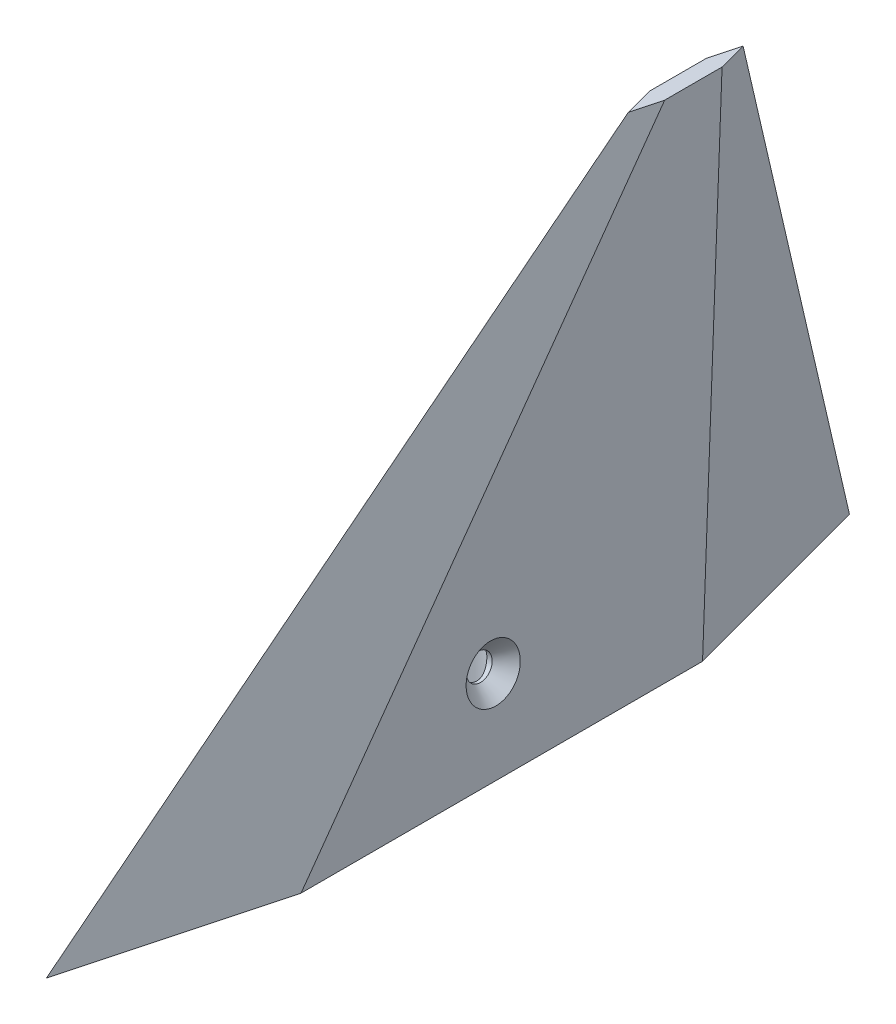
ISO-10303-21;
HEADER;
FILE_DESCRIPTION(('STEP AP214'),'2;1');
FILE_NAME('part.step','',(''),(''),'','','');
FILE_SCHEMA(('AUTOMOTIVE_DESIGN { 1 0 10303 214 1 1 1 1 }'));
ENDSEC;
DATA;
#1=APPLICATION_CONTEXT('core data for automotive mechanical design processes');
#2=APPLICATION_PROTOCOL_DEFINITION('international standard','automotive_design',2000,#1);
#3=PRODUCT_CONTEXT('',#1,'mechanical');
#4=PRODUCT('Part','Part','',(#3));
#5=PRODUCT_RELATED_PRODUCT_CATEGORY('part','',(#4));
#6=PRODUCT_DEFINITION_FORMATION('','',#4);
#7=PRODUCT_DEFINITION_CONTEXT('part definition',#1,'design');
#8=PRODUCT_DEFINITION('design','',#6,#7);
#9=PRODUCT_DEFINITION_SHAPE('','',#8);
#10=(LENGTH_UNIT() NAMED_UNIT(*) SI_UNIT(.MILLI.,.METRE.));
#11=(NAMED_UNIT(*) PLANE_ANGLE_UNIT() SI_UNIT($,.RADIAN.));
#12=(NAMED_UNIT(*) SI_UNIT($,.STERADIAN.) SOLID_ANGLE_UNIT());
#13=UNCERTAINTY_MEASURE_WITH_UNIT(LENGTH_MEASURE(1.E-05),#10,'distance_accuracy_value','');
#14=(GEOMETRIC_REPRESENTATION_CONTEXT(3) GLOBAL_UNCERTAINTY_ASSIGNED_CONTEXT((#13)) GLOBAL_UNIT_ASSIGNED_CONTEXT((#10,
#11,#12)) REPRESENTATION_CONTEXT('',''));
#15=CARTESIAN_POINT('',(0.,0.,0.));
#16=DIRECTION('',(0.,0.,1.));
#17=DIRECTION('',(1.,0.,0.));
#18=AXIS2_PLACEMENT_3D('',#15,#16,#17);
#19=CARTESIAN_POINT('',(0.,20.,-70.));
#20=DIRECTION('',(0.,1.,0.));
#21=DIRECTION('',(0.,0.,1.));
#22=AXIS2_PLACEMENT_3D('',#19,#20,#21);
#23=PLANE('',#22);
#24=CARTESIAN_POINT('',(0.,20.,-70.));
#25=DIRECTION('',(0.,1.,0.));
#26=DIRECTION('',(0.,0.,1.));
#27=AXIS2_PLACEMENT_3D('',#24,#25,#26);
#28=CIRCLE('',#27,5.05);
#29=CARTESIAN_POINT('',(0.,20.,-64.95));
#30=VERTEX_POINT('',#29);
#31=EDGE_CURVE('E18',#30,#30,#28,.F.);
#32=ORIENTED_EDGE('',*,*,#31,.T.);
#33=EDGE_LOOP('',(#32));
#34=FACE_BOUND('',#33,.T.);
#35=ADVANCED_FACE('F15',(#34),#23,.F.);
#36=CARTESIAN_POINT('',(2.90361063953875,14.4249579258095,-70.));
#37=DIRECTION('',(0.99498969745958,0.0999775072168431,0.));
#38=DIRECTION('',(-0.0999775072168431,0.99498969745958,0.));
#39=AXIS2_PLACEMENT_3D('',#36,#37,#38);
#40=CYLINDRICAL_SURFACE('',#39,2.25);
#41=CARTESIAN_POINT('',(4.52106182218293,14.5874809526293,-67.75));
#42=CARTESIAN_POINT('',(4.5210688457898,14.711222096715,-67.7500056475761));
#43=CARTESIAN_POINT('',(4.52615905394233,14.8350194107009,-67.7601560254056));
#44=CARTESIAN_POINT('',(4.54555991379443,15.0787815739717,-67.7998085138221));
#45=CARTESIAN_POINT('',(4.55988248539347,15.1987412580337,-67.8293356426125));
#46=CARTESIAN_POINT('',(4.5955898558596,15.4310432731963,-67.9060041834686));
#47=CARTESIAN_POINT('',(4.61693955458819,15.5434201843891,-67.9530582004132));
#48=CARTESIAN_POINT('',(4.66421918022442,15.7589215106484,-68.0632133247816));
#49=CARTESIAN_POINT('',(4.69014977580094,15.8620445716215,-68.126316775517));
#50=CARTESIAN_POINT('',(4.74625817043075,16.0653594591065,-68.2730938594594));
#51=CARTESIAN_POINT('',(4.77660978796748,16.1645812448373,-68.3580482463821));
#52=CARTESIAN_POINT('',(4.83640784385219,16.3476281544216,-68.543582500153));
#53=CARTESIAN_POINT('',(4.86585377795911,16.431444826174,-68.6441708891595));
#54=CARTESIAN_POINT('',(4.92139877818289,16.5829562774518,-68.8618973841704));
#55=CARTESIAN_POINT('',(4.94738971059083,16.6501701513079,-68.9794005816925));
#56=CARTESIAN_POINT('',(4.99186019782889,16.7622985613542,-69.2257981253947));
#57=CARTESIAN_POINT('',(5.01035568027933,16.807260427922,-69.3546676009177));
#58=CARTESIAN_POINT('',(5.03241774090947,16.8603135841319,-69.5706022330422));
#59=CARTESIAN_POINT('',(5.0389737159951,16.8758851699486,-69.6555875341549));
#60=CARTESIAN_POINT('',(5.0477662464401,16.8967095794458,-69.8270374254423));
#61=CARTESIAN_POINT('',(5.05000336193721,16.9019637412538,-69.9135018223167));
#62=CARTESIAN_POINT('',(5.04999546152978,16.901952855435,-70.1167688090623));
#63=CARTESIAN_POINT('',(5.04590791384723,16.8923630620204,-70.2335991797148));
#64=CARTESIAN_POINT('',(5.02999294591679,16.8545070523786,-70.4636969886369));
#65=CARTESIAN_POINT('',(5.01815793507534,16.8262225196777,-70.576960818397));
#66=CARTESIAN_POINT('',(4.98804571430895,16.7525268131785,-70.7963157852418));
#67=CARTESIAN_POINT('',(4.96979345529977,16.7071819245832,-70.9024328323239));
#68=CARTESIAN_POINT('',(4.92856613526714,16.6011924949452,-71.1056701084215));
#69=CARTESIAN_POINT('',(4.90559046770435,16.5405459887734,-71.2027891796689));
#70=CARTESIAN_POINT('',(4.85526601035895,16.4013312554559,-71.3925376446246));
#71=CARTESIAN_POINT('',(4.8277278157962,16.3218379568,-71.484436387291));
#72=CARTESIAN_POINT('',(4.77204450888816,16.1496179889118,-71.6547309141266));
#73=CARTESIAN_POINT('',(4.74389893891957,16.0568810231931,-71.7331160863206));
#74=CARTESIAN_POINT('',(4.68685289679935,15.8500194523502,-71.8822650019308));
#75=CARTESIAN_POINT('',(4.65816881254305,15.7346778667572,-71.9514331827604));
#76=CARTESIAN_POINT('',(4.60685286838601,15.4929092516184,-72.0696827333515));
#77=CARTESIAN_POINT('',(4.58421560545601,15.3664922533712,-72.1187820562258));
#78=CARTESIAN_POINT('',(4.55185280245007,15.1315340677342,-72.1872978444479));
#79=CARTESIAN_POINT('',(4.54046377969641,15.0243647378292,-72.2106522031936));
#80=CARTESIAN_POINT('',(4.52506933756239,14.8072967568358,-72.2419997368795));
#81=CARTESIAN_POINT('',(4.52105938300783,14.6973998242572,-72.2500023471305));
#82=CARTESIAN_POINT('',(4.52106441455628,14.4706583618991,-72.2499975054523));
#83=CARTESIAN_POINT('',(4.52559924470736,14.3538109897056,-72.2409529346035));
#84=CARTESIAN_POINT('',(4.54332792292385,14.1236004914112,-72.2047821023095));
#85=CARTESIAN_POINT('',(4.55652502353808,14.010238690833,-72.1776490488583));
#86=CARTESIAN_POINT('',(4.5899632528388,13.7905029543171,-72.1062454766109));
#87=CARTESIAN_POINT('',(4.61018722115405,13.6841127385437,-72.062016678147));
#88=CARTESIAN_POINT('',(4.65539914238684,13.480473346232,-71.9577979115416));
#89=CARTESIAN_POINT('',(4.68038859614529,13.3832270639266,-71.89780297576));
#90=CARTESIAN_POINT('',(4.7337093864196,13.1957536387241,-71.7607169292021));
#91=CARTESIAN_POINT('',(4.76213882257942,13.1060160288075,-71.6829955174366));
#92=CARTESIAN_POINT('',(4.81853966201812,12.9401904022967,-71.5139717602945));
#93=CARTESIAN_POINT('',(4.84651088622862,12.8641076115496,-71.4226642397154));
#94=CARTESIAN_POINT('',(4.90102695817271,12.7227274900476,-71.2222451264734));
#95=CARTESIAN_POINT('',(4.92736630165856,12.6584306125668,-71.1123685018902));
#96=CARTESIAN_POINT('',(4.97370046043886,12.548778633825,-70.8823437649854));
#97=CARTESIAN_POINT('',(4.99369957963128,12.5034106765132,-70.7622026910526));
#98=CARTESIAN_POINT('',(5.02261413621195,12.4388463836962,-70.535438161491));
#99=CARTESIAN_POINT('',(5.03281233864198,12.4165707853615,-70.4298460404631));
#100=CARTESIAN_POINT('',(5.04650584837021,12.3867973110165,-70.2161763175487));
#101=CARTESIAN_POINT('',(5.05000229911963,12.3792969140588,-70.1080991428466));
#102=CARTESIAN_POINT('',(5.0499973921066,12.3793018239934,-69.8773830479771));
#103=CARTESIAN_POINT('',(5.04549315803883,12.3889576925939,-69.7547378308944));
#104=CARTESIAN_POINT('',(5.02793063197852,12.427242264426,-69.513051017685));
#105=CARTESIAN_POINT('',(5.0148682021105,12.4558801455118,-69.3940111939043));
#106=CARTESIAN_POINT('',(4.98153687108553,12.5310982590985,-69.1631147175834));
#107=CARTESIAN_POINT('',(4.96128275525255,12.5776416959881,-69.0512438793153));
#108=CARTESIAN_POINT('',(4.91551818156173,12.6873652281646,-68.8371682678449));
#109=CARTESIAN_POINT('',(4.89000681989101,12.7505481845969,-68.7349651611092));
#110=CARTESIAN_POINT('',(4.83519620461533,12.8945767379128,-68.5391517392773));
#111=CARTESIAN_POINT('',(4.80579560332737,12.9759632794316,-68.4459675507173));
#112=CARTESIAN_POINT('',(4.74697534360134,13.1533261250895,-68.2746167595827));
#113=CARTESIAN_POINT('',(4.71755568222315,13.2493081803153,-68.1964561043546));
#114=CARTESIAN_POINT('',(4.66137041585172,13.4561182912732,-68.0557781057146));
#115=CARTESIAN_POINT('',(4.63467646693185,13.5672238772899,-67.9936380421819));
#116=CARTESIAN_POINT('',(4.58820197482769,13.7997514249507,-67.8895047672239));
#117=CARTESIAN_POINT('',(4.56841083218201,13.9211572107195,-67.847480629916));
#118=CARTESIAN_POINT('',(4.54289234091083,14.1338842341196,-67.7942777376531));
#119=CARTESIAN_POINT('',(4.53474310384045,14.2235935688873,-67.7776683938712));
#120=CARTESIAN_POINT('',(4.52382555739226,14.4046854967245,-67.7555280715412));
#121=CARTESIAN_POINT('',(4.52105663353394,14.4960678975113,-67.7499958278858));
#122=CARTESIAN_POINT('',(4.52106182218293,14.5874809526293,-67.75));
#123=B_SPLINE_CURVE_WITH_KNOTS('',3,(#41,#42,#43,#44,#45,#46,#47,#48,#49,#50,#51,#52,#53,#54,
#55,#56,#57,#58,#59,#60,#61,#62,#63,#64,#65,#66,#67,#68,#69,#70,#71,#72,#73,#74,#75,#76,#77,#78,
#79,#80,#81,#82,#83,#84,#85,#86,#87,#88,#89,#90,#91,#92,#93,#94,#95,#96,#97,#98,#99,#100,#101,
#102,#103,#104,#105,#106,#107,#108,#109,#110,#111,#112,#113,#114,#115,#116,#117,#118,#119,#120,
#121,#122),.UNSPECIFIED.,.T.,.F.,(4,2,2,2,2,2,2,2,2,2,2,2,2,2,2,2,2,2,2,2,2,2,2,2,2,2,2,2,2,2,2,
2,2,2,2,2,2,2,2,2,4),(0.,0.37084976032227,0.742179286197476,1.1116814953905,1.48123768508057,
1.88176684823227,2.28251511217943,2.69378206262457,3.10417044119816,3.36344445818436,
3.62268484617198,3.97264818848657,4.32295492234107,4.67191442164606,5.0209187593377,
5.39318402617092,5.76574030796685,6.17633924588454,6.58657006379868,6.9161491458406,
7.2455256008885,7.5955893363905,7.94578459067154,8.29513057239289,8.64458675930697,
9.00924849217218,9.37404948880124,9.76217194701097,10.1500303713264,10.47402744006,
10.7979692235706,11.1654166711726,11.5330419103303,11.8999156869052,12.2668525882216,
12.6466364756717,13.0265703994236,13.4147691423633,13.8023691429502,14.076363554806,
14.3503266721777),.UNSPECIFIED.);
#124=CARTESIAN_POINT('',(4.52106182218293,14.5874809526293,-67.75));
#125=VERTEX_POINT('',#124);
#126=EDGE_CURVE('E101',#125,#125,#123,.T.);
#127=ORIENTED_EDGE('',*,*,#126,.T.);
#128=EDGE_LOOP('',(#127));
#129=FACE_BOUND('',#128,.T.);
#130=CARTESIAN_POINT('',(5.44083436813033,14.6799005692195,-70.));
#131=DIRECTION('',(0.99498969745958,0.0999775072168431,0.));
#132=DIRECTION('',(0.,3.23815048849463E-13,-1.));
#133=AXIS2_PLACEMENT_3D('',#130,#131,#132);
#134=CIRCLE('',#133,2.24999999999681);
#135=CARTESIAN_POINT('',(5.44083436813025,14.6799005692202,-72.2499999999968));
#136=VERTEX_POINT('',#135);
#137=EDGE_CURVE('E102',#136,#136,#134,.T.);
#138=ORIENTED_EDGE('',*,*,#137,.T.);
#139=EDGE_LOOP('',(#138));
#140=FACE_BOUND('',#139,.T.);
#141=ADVANCED_FACE('F116',(#129,#140),#40,.F.);
#142=CARTESIAN_POINT('',(7.87855912682279,14.9248454618923,-70.));
#143=DIRECTION('',(0.99498969745958,0.0999775072168432,0.));
#144=DIRECTION('',(-0.0999775072168432,0.99498969745958,0.));
#145=AXIS2_PLACEMENT_3D('',#142,#143,#144);
#146=CONICAL_SURFACE('',#145,4.69999999983656,0.785398163381872);
#147=ORIENTED_EDGE('',*,*,#137,.F.);
#148=EDGE_LOOP('',(#147));
#149=FACE_BOUND('',#148,.T.);
#150=CARTESIAN_POINT('',(7.87855912693746,14.9248454619039,-70.));
#151=DIRECTION('',(0.99498969745958,0.0999775072168432,0.));
#152=DIRECTION('',(-0.0999775072168432,0.99498969745958,0.));
#153=AXIS2_PLACEMENT_3D('',#150,#151,#152);
#154=CIRCLE('',#153,4.69999999995181);
#155=CARTESIAN_POINT('',(7.40866484302312,19.6012970399159,-70.));
#156=VERTEX_POINT('',#155);
#157=EDGE_CURVE('E99',#156,#156,#154,.T.);
#158=ORIENTED_EDGE('',*,*,#157,.T.);
#159=EDGE_LOOP('',(#158));
#160=FACE_BOUND('',#159,.T.);
#161=ADVANCED_FACE('F123',(#149,#160),#146,.F.);
#162=CARTESIAN_POINT('',(0.,0.,-70.));
#163=DIRECTION('',(0.,1.,0.));
#164=DIRECTION('',(0.,0.,1.));
#165=AXIS2_PLACEMENT_3D('',#162,#163,#164);
#166=CYLINDRICAL_SURFACE('',#165,5.05);
#167=ORIENTED_EDGE('',*,*,#126,.F.);
#168=EDGE_LOOP('',(#167));
#169=FACE_BOUND('',#168,.T.);
#170=ORIENTED_EDGE('',*,*,#31,.F.);
#171=EDGE_LOOP('',(#170));
#172=FACE_BOUND('',#171,.T.);
#173=CARTESIAN_POINT('',(0.,0.,-70.));
#174=DIRECTION('',(0.,1.,0.));
#175=DIRECTION('',(0.,0.,1.));
#176=AXIS2_PLACEMENT_3D('',#173,#174,#175);
#177=CIRCLE('',#176,5.05);
#178=CARTESIAN_POINT('',(0.,0.,-64.95));
#179=VERTEX_POINT('',#178);
#180=EDGE_CURVE('E105',#179,#179,#177,.F.);
#181=ORIENTED_EDGE('',*,*,#180,.T.);
#182=EDGE_LOOP('',(#181));
#183=FACE_BOUND('',#182,.T.);
#184=ADVANCED_FACE('F119',(#169,#172,#183),#166,.F.);
#185=CARTESIAN_POINT('',(0.,80.,-101.442282274311));
#186=DIRECTION('',(-0.917763978694159,-0.311826115815043,-0.245914116933474));
#187=DIRECTION('',(0.321705159693561,-0.946839896828677,0.));
#188=AXIS2_PLACEMENT_3D('',#185,#186,#187);
#189=PLANE('',#188);
#190=DIRECTION('',(0.,-0.61923406116435,0.785206455331275));
#191=VECTOR('',#190,1.);
#192=CARTESIAN_POINT('',(0.,80.,-101.442282274311));
#193=LINE('',#192,#191);
#194=CARTESIAN_POINT('',(0.,80.,-101.442282274311));
#195=VERTEX_POINT('',#194);
#196=CARTESIAN_POINT('',(0.,0.,0.));
#197=VERTEX_POINT('',#196);
#198=EDGE_CURVE('E72',#195,#197,#193,.T.);
#199=ORIENTED_EDGE('',*,*,#198,.T.);
#200=DIRECTION('',(0.258819045102521,0.,-0.965925826289068));
#201=VECTOR('',#200,1.);
#202=CARTESIAN_POINT('',(0.,0.,0.));
#203=LINE('',#202,#201);
#204=CARTESIAN_POINT('',(9.37822173508932,0.,-35.));
#205=VERTEX_POINT('',#204);
#206=EDGE_CURVE('E75',#197,#205,#203,.T.);
#207=ORIENTED_EDGE('',*,*,#206,.T.);
#208=DIRECTION('',(-0.0747365402820964,0.743788174705871,-0.664224059120393));
#209=VECTOR('',#208,1.);
#210=CARTESIAN_POINT('',(9.37822173508929,0.,-35.));
#211=LINE('',#210,#209);
#212=CARTESIAN_POINT('',(1.33974596215561,80.,-106.442282274311));
#213=VERTEX_POINT('',#212);
#214=EDGE_CURVE('E66',#205,#213,#211,.T.);
#215=ORIENTED_EDGE('',*,*,#214,.T.);
#216=DIRECTION('',(0.25881904510252,0.,-0.965925826289069));
#217=VECTOR('',#216,1.);
#218=CARTESIAN_POINT('',(0.,80.,-101.442282274311));
#219=LINE('',#218,#217);
#220=EDGE_CURVE('E76',#195,#213,#219,.T.);
#221=ORIENTED_EDGE('',*,*,#220,.F.);
#222=EDGE_LOOP('',(#199,#207,#215,#221));
#223=FACE_BOUND('',#222,.T.);
#224=ADVANCED_FACE('F74',(#223),#189,.F.);
#225=CARTESIAN_POINT('',(1.33974596215561,80.,-106.442282274311));
#226=DIRECTION('',(-0.99498969745958,-0.0999775072168431,0.));
#227=DIRECTION('',(0.0999775072168431,-0.99498969745958,0.));
#228=AXIS2_PLACEMENT_3D('',#225,#226,#227);
#229=PLANE('',#228);
#230=ORIENTED_EDGE('',*,*,#157,.F.);
#231=EDGE_LOOP('',(#230));
#232=FACE_BOUND('',#231,.T.);
#233=ORIENTED_EDGE('',*,*,#214,.F.);
#234=DIRECTION('',(0.,0.,1.));
#235=VECTOR('',#234,1.);
#236=CARTESIAN_POINT('',(9.37822173508929,0.,-70.));
#237=LINE('',#236,#235);
#238=CARTESIAN_POINT('',(9.37822173508927,0.,-105.));
#239=VERTEX_POINT('',#238);
#240=EDGE_CURVE('E89',#205,#239,#237,.F.);
#241=ORIENTED_EDGE('',*,*,#240,.T.);
#242=DIRECTION('',(-0.0989802239030455,0.985064598801899,-0.140892339974028));
#243=VECTOR('',#242,1.);
#244=CARTESIAN_POINT('',(9.37822173508923,0.,-105.));
#245=LINE('',#244,#243);
#246=CARTESIAN_POINT('',(1.33974596215561,80.,-116.442282274311));
#247=VERTEX_POINT('',#246);
#248=EDGE_CURVE('E82',#239,#247,#245,.T.);
#249=ORIENTED_EDGE('',*,*,#248,.T.);
#250=DIRECTION('',(0.,0.,1.));
#251=VECTOR('',#250,1.);
#252=CARTESIAN_POINT('',(1.33974596215561,80.,-111.442282274311));
#253=LINE('',#252,#251);
#254=EDGE_CURVE('E258',#213,#247,#253,.F.);
#255=ORIENTED_EDGE('',*,*,#254,.F.);
#256=EDGE_LOOP('',(#233,#241,#249,#255));
#257=FACE_BOUND('',#256,.T.);
#258=ADVANCED_FACE('F157',(#232,#257),#229,.F.);
#259=CARTESIAN_POINT('',(1.33974596215561,80.,-116.442282274311));
#260=DIRECTION('',(-0.964189612391014,-0.0599307176650203,0.258353827990649));
#261=DIRECTION('',(0.25881904510252,0.,0.965925826289068));
#262=AXIS2_PLACEMENT_3D('',#259,#260,#261);
#263=PLANE('',#262);
#264=ORIENTED_EDGE('',*,*,#248,.F.);
#265=DIRECTION('',(-0.258819045102521,0.,-0.965925826289068));
#266=VECTOR('',#265,1.);
#267=CARTESIAN_POINT('',(9.37822173508929,0.,-105.));
#268=LINE('',#267,#266);
#269=CARTESIAN_POINT('',(0.,0.,-140.));
#270=VERTEX_POINT('',#269);
#271=EDGE_CURVE('E109',#239,#270,#268,.T.);
#272=ORIENTED_EDGE('',*,*,#271,.T.);
#273=DIRECTION('',(0.,0.974133962376919,0.225971288759973));
#274=VECTOR('',#273,1.);
#275=CARTESIAN_POINT('',(0.,0.,-140.));
#276=LINE('',#275,#274);
#277=CARTESIAN_POINT('',(0.,80.,-121.442282274311));
#278=VERTEX_POINT('',#277);
#279=EDGE_CURVE('E252',#270,#278,#276,.T.);
#280=ORIENTED_EDGE('',*,*,#279,.T.);
#281=DIRECTION('',(-0.25881904510252,0.,-0.965925826289068));
#282=VECTOR('',#281,1.);
#283=CARTESIAN_POINT('',(1.33974596215561,80.,-116.442282274311));
#284=LINE('',#283,#282);
#285=EDGE_CURVE('E247',#247,#278,#284,.T.);
#286=ORIENTED_EDGE('',*,*,#285,.F.);
#287=EDGE_LOOP('',(#264,#272,#280,#286));
#288=FACE_BOUND('',#287,.T.);
#289=ADVANCED_FACE('F155',(#288),#263,.F.);
#290=CARTESIAN_POINT('',(-1.33974596215561,80.,-106.442282274311));
#291=DIRECTION('',(0.917763978694159,-0.311826115815043,-0.245914116933474));
#292=DIRECTION('',(0.321705159693561,0.946839896828677,0.));
#293=AXIS2_PLACEMENT_3D('',#290,#291,#292);
#294=PLANE('',#293);
#295=DIRECTION('',(-0.0747365402820964,-0.743788174705871,0.664224059120393));
#296=VECTOR('',#295,1.);
#297=CARTESIAN_POINT('',(-1.33974596215561,80.,-106.442282274311));
#298=LINE('',#297,#296);
#299=CARTESIAN_POINT('',(-1.33974596215561,80.,-106.442282274311));
#300=VERTEX_POINT('',#299);
#301=CARTESIAN_POINT('',(-9.37822173508931,0.,-35.));
#302=VERTEX_POINT('',#301);
#303=EDGE_CURVE('E93',#300,#302,#298,.T.);
#304=ORIENTED_EDGE('',*,*,#303,.T.);
#305=DIRECTION('',(0.258819045102521,0.,0.965925826289068));
#306=VECTOR('',#305,1.);
#307=CARTESIAN_POINT('',(-9.37822173508929,0.,-35.));
#308=LINE('',#307,#306);
#309=EDGE_CURVE('E81',#302,#197,#308,.T.);
#310=ORIENTED_EDGE('',*,*,#309,.T.);
#311=ORIENTED_EDGE('',*,*,#198,.F.);
#312=DIRECTION('',(0.25881904510252,0.,0.965925826289069));
#313=VECTOR('',#312,1.);
#314=CARTESIAN_POINT('',(-1.33974596215561,80.,-106.442282274311));
#315=LINE('',#314,#313);
#316=EDGE_CURVE('E255',#300,#195,#315,.T.);
#317=ORIENTED_EDGE('',*,*,#316,.F.);
#318=EDGE_LOOP('',(#304,#310,#311,#317));
#319=FACE_BOUND('',#318,.T.);
#320=ADVANCED_FACE('F92',(#319),#294,.F.);
#321=CARTESIAN_POINT('',(0.,0.,-70.));
#322=DIRECTION('',(0.,1.,0.));
#323=DIRECTION('',(0.,0.,1.));
#324=AXIS2_PLACEMENT_3D('',#321,#322,#323);
#325=PLANE('',#324);
#326=ORIENTED_EDGE('',*,*,#180,.F.);
#327=EDGE_LOOP('',(#326));
#328=FACE_BOUND('',#327,.T.);
#329=ORIENTED_EDGE('',*,*,#271,.F.);
#330=ORIENTED_EDGE('',*,*,#240,.F.);
#331=ORIENTED_EDGE('',*,*,#206,.F.);
#332=ORIENTED_EDGE('',*,*,#309,.F.);
#333=DIRECTION('',(0.,0.,1.));
#334=VECTOR('',#333,1.);
#335=CARTESIAN_POINT('',(-9.37822173508929,0.,-116.442282274311));
#336=LINE('',#335,#334);
#337=CARTESIAN_POINT('',(-9.37822173508926,0.,-105.));
#338=VERTEX_POINT('',#337);
#339=EDGE_CURVE('E262',#302,#338,#336,.F.);
#340=ORIENTED_EDGE('',*,*,#339,.T.);
#341=DIRECTION('',(0.25881904510252,0.,-0.965925826289068));
#342=VECTOR('',#341,1.);
#343=CARTESIAN_POINT('',(-4.6394294314222,0.,-122.685413643802));
#344=LINE('',#343,#342);
#345=EDGE_CURVE('E108',#338,#270,#344,.T.);
#346=ORIENTED_EDGE('',*,*,#345,.T.);
#347=EDGE_LOOP('',(#329,#330,#331,#332,#340,#346));
#348=FACE_BOUND('',#347,.T.);
#349=ADVANCED_FACE('F86',(#328,#348),#325,.F.);
#350=CARTESIAN_POINT('',(0.,80.,-121.442282274311));
#351=DIRECTION('',(0.964189612391014,-0.0599307176650203,0.258353827990649));
#352=DIRECTION('',(0.25881904510252,0.,-0.965925826289068));
#353=AXIS2_PLACEMENT_3D('',#350,#351,#352);
#354=PLANE('',#353);
#355=ORIENTED_EDGE('',*,*,#279,.F.);
#356=ORIENTED_EDGE('',*,*,#345,.F.);
#357=DIRECTION('',(0.0989802239030463,0.985064598801899,-0.140892339974028));
#358=VECTOR('',#357,1.);
#359=CARTESIAN_POINT('',(-9.37822173508929,0.,-105.));
#360=LINE('',#359,#358);
#361=CARTESIAN_POINT('',(-1.33974596215561,80.,-116.442282274311));
#362=VERTEX_POINT('',#361);
#363=EDGE_CURVE('E24',#338,#362,#360,.T.);
#364=ORIENTED_EDGE('',*,*,#363,.T.);
#365=DIRECTION('',(-0.25881904510252,0.,0.965925826289069));
#366=VECTOR('',#365,1.);
#367=CARTESIAN_POINT('',(0.,80.,-121.442282274311));
#368=LINE('',#367,#366);
#369=EDGE_CURVE('E32',#278,#362,#368,.T.);
#370=ORIENTED_EDGE('',*,*,#369,.F.);
#371=EDGE_LOOP('',(#355,#356,#364,#370));
#372=FACE_BOUND('',#371,.T.);
#373=ADVANCED_FACE('F143',(#372),#354,.F.);
#374=CARTESIAN_POINT('',(0.,80.,-111.442282274311));
#375=DIRECTION('',(0.,1.,0.));
#376=DIRECTION('',(-1.,0.,0.));
#377=AXIS2_PLACEMENT_3D('',#374,#375,#376);
#378=PLANE('',#377);
#379=ORIENTED_EDGE('',*,*,#254,.T.);
#380=ORIENTED_EDGE('',*,*,#285,.T.);
#381=ORIENTED_EDGE('',*,*,#369,.T.);
#382=DIRECTION('',(0.,0.,1.));
#383=VECTOR('',#382,1.);
#384=CARTESIAN_POINT('',(-1.33974596215561,80.,-116.442282274311));
#385=LINE('',#384,#383);
#386=EDGE_CURVE('E10',#362,#300,#385,.T.);
#387=ORIENTED_EDGE('',*,*,#386,.T.);
#388=ORIENTED_EDGE('',*,*,#316,.T.);
#389=ORIENTED_EDGE('',*,*,#220,.T.);
#390=EDGE_LOOP('',(#379,#380,#381,#387,#388,#389));
#391=FACE_BOUND('',#390,.T.);
#392=ADVANCED_FACE('F137',(#391),#378,.T.);
#393=CARTESIAN_POINT('',(-1.33974596215561,80.,-116.442282274311));
#394=DIRECTION('',(0.99498969745958,-0.0999775072168431,0.));
#395=DIRECTION('',(0.0999775072168431,0.99498969745958,0.));
#396=AXIS2_PLACEMENT_3D('',#393,#394,#395);
#397=PLANE('',#396);
#398=ORIENTED_EDGE('',*,*,#363,.F.);
#399=ORIENTED_EDGE('',*,*,#339,.F.);
#400=ORIENTED_EDGE('',*,*,#303,.F.);
#401=ORIENTED_EDGE('',*,*,#386,.F.);
#402=EDGE_LOOP('',(#398,#399,#400,#401));
#403=FACE_BOUND('',#402,.T.);
#404=ADVANCED_FACE('F135',(#403),#397,.F.);
#405=CLOSED_SHELL('',(#35,#141,#161,#184,#224,#258,#289,#320,#349,#373,#392,#404));
#406=MANIFOLD_SOLID_BREP('B1',#405);
#407=ADVANCED_BREP_SHAPE_REPRESENTATION('',(#18,#406),#14);
#408=SHAPE_DEFINITION_REPRESENTATION(#9,#407);
ENDSEC;
END-ISO-10303-21;
